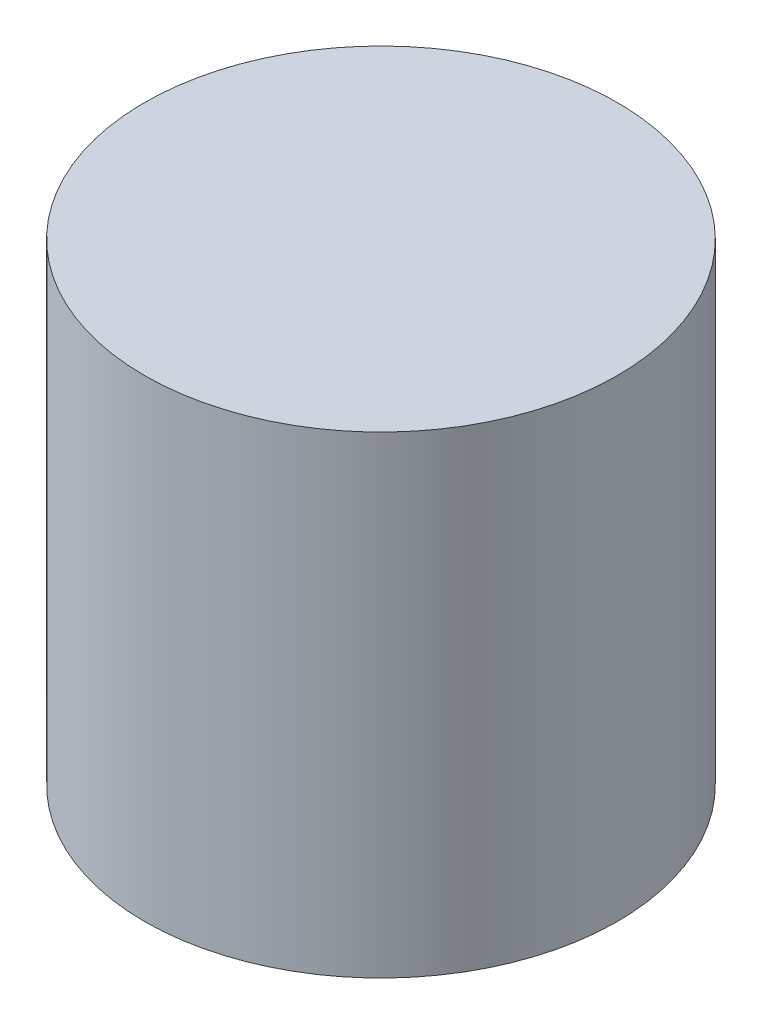
ISO-10303-21;
HEADER;
FILE_DESCRIPTION(('STEP AP214'),'2;1');
FILE_NAME('part.step','',(''),(''),'','','');
FILE_SCHEMA(('AUTOMOTIVE_DESIGN { 1 0 10303 214 1 1 1 1 }'));
ENDSEC;
DATA;
#1=APPLICATION_CONTEXT('core data for automotive mechanical design processes');
#2=APPLICATION_PROTOCOL_DEFINITION('international standard','automotive_design',2000,#1);
#3=PRODUCT_CONTEXT('',#1,'mechanical');
#4=PRODUCT('Part','Part','',(#3));
#5=PRODUCT_RELATED_PRODUCT_CATEGORY('part','',(#4));
#6=PRODUCT_DEFINITION_FORMATION('','',#4);
#7=PRODUCT_DEFINITION_CONTEXT('part definition',#1,'design');
#8=PRODUCT_DEFINITION('design','',#6,#7);
#9=PRODUCT_DEFINITION_SHAPE('','',#8);
#10=(LENGTH_UNIT() NAMED_UNIT(*) SI_UNIT(.MILLI.,.METRE.));
#11=(NAMED_UNIT(*) PLANE_ANGLE_UNIT() SI_UNIT($,.RADIAN.));
#12=(NAMED_UNIT(*) SI_UNIT($,.STERADIAN.) SOLID_ANGLE_UNIT());
#13=UNCERTAINTY_MEASURE_WITH_UNIT(LENGTH_MEASURE(1.E-05),#10,'distance_accuracy_value','');
#14=(GEOMETRIC_REPRESENTATION_CONTEXT(3) GLOBAL_UNCERTAINTY_ASSIGNED_CONTEXT((#13)) GLOBAL_UNIT_ASSIGNED_CONTEXT((#10,
#11,#12)) REPRESENTATION_CONTEXT('',''));
#15=CARTESIAN_POINT('',(0.,0.,0.));
#16=DIRECTION('',(0.,0.,1.));
#17=DIRECTION('',(1.,0.,0.));
#18=AXIS2_PLACEMENT_3D('',#15,#16,#17);
#19=CARTESIAN_POINT('',(0.,12.7,0.));
#20=DIRECTION('',(0.,-1.,0.));
#21=DIRECTION('',(0.,0.,-1.));
#22=AXIS2_PLACEMENT_3D('',#19,#20,#21);
#23=CYLINDRICAL_SURFACE('',#22,6.35);
#24=CARTESIAN_POINT('',(0.,12.7,0.));
#25=DIRECTION('',(0.,1.,0.));
#26=DIRECTION('',(0.,0.,1.));
#27=AXIS2_PLACEMENT_3D('',#24,#25,#26);
#28=CIRCLE('',#27,6.35);
#29=CARTESIAN_POINT('',(0.,12.7,6.35));
#30=VERTEX_POINT('',#29);
#31=EDGE_CURVE('E10',#30,#30,#28,.T.);
#32=ORIENTED_EDGE('',*,*,#31,.F.);
#33=EDGE_LOOP('',(#32));
#34=FACE_BOUND('',#33,.T.);
#35=CARTESIAN_POINT('',(0.,0.,0.));
#36=DIRECTION('',(0.,1.,0.));
#37=DIRECTION('',(0.,0.,1.));
#38=AXIS2_PLACEMENT_3D('',#35,#36,#37);
#39=CIRCLE('',#38,6.35);
#40=CARTESIAN_POINT('',(0.,0.,6.35));
#41=VERTEX_POINT('',#40);
#42=EDGE_CURVE('E38',#41,#41,#39,.T.);
#43=ORIENTED_EDGE('',*,*,#42,.T.);
#44=EDGE_LOOP('',(#43));
#45=FACE_BOUND('',#44,.T.);
#46=ADVANCED_FACE('F35',(#34,#45),#23,.T.);
#47=CARTESIAN_POINT('',(0.,12.7,0.));
#48=DIRECTION('',(0.,1.,0.));
#49=DIRECTION('',(0.,0.,1.));
#50=AXIS2_PLACEMENT_3D('',#47,#48,#49);
#51=PLANE('',#50);
#52=ORIENTED_EDGE('',*,*,#31,.T.);
#53=EDGE_LOOP('',(#52));
#54=FACE_BOUND('',#53,.T.);
#55=ADVANCED_FACE('F50',(#54),#51,.T.);
#56=CARTESIAN_POINT('',(0.,0.,0.));
#57=DIRECTION('',(0.,1.,0.));
#58=DIRECTION('',(0.,0.,1.));
#59=AXIS2_PLACEMENT_3D('',#56,#57,#58);
#60=PLANE('',#59);
#61=ORIENTED_EDGE('',*,*,#42,.F.);
#62=EDGE_LOOP('',(#61));
#63=FACE_BOUND('',#62,.T.);
#64=ADVANCED_FACE('F48',(#63),#60,.F.);
#65=CLOSED_SHELL('',(#46,#55,#64));
#66=MANIFOLD_SOLID_BREP('B2',#65);
#67=ADVANCED_BREP_SHAPE_REPRESENTATION('',(#18,#66),#14);
#68=SHAPE_DEFINITION_REPRESENTATION(#9,#67);
ENDSEC;
END-ISO-10303-21;
